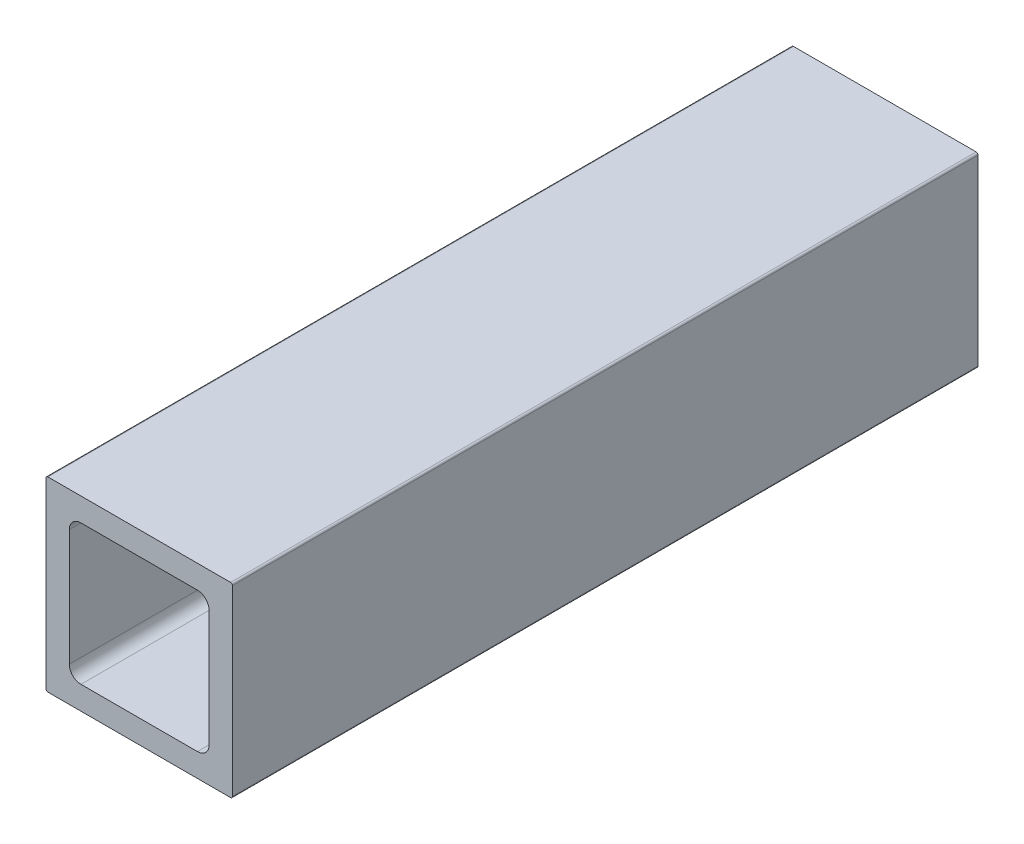
ISO-10303-21;
HEADER;
FILE_DESCRIPTION(('STEP AP214'),'2;1');
FILE_NAME('part.step','',(''),(''),'','','');
FILE_SCHEMA(('AUTOMOTIVE_DESIGN { 1 0 10303 214 1 1 1 1 }'));
ENDSEC;
DATA;
#1=APPLICATION_CONTEXT('core data for automotive mechanical design processes');
#2=APPLICATION_PROTOCOL_DEFINITION('international standard','automotive_design',2000,#1);
#3=PRODUCT_CONTEXT('',#1,'mechanical');
#4=PRODUCT('Part','Part','',(#3));
#5=PRODUCT_RELATED_PRODUCT_CATEGORY('part','',(#4));
#6=PRODUCT_DEFINITION_FORMATION('','',#4);
#7=PRODUCT_DEFINITION_CONTEXT('part definition',#1,'design');
#8=PRODUCT_DEFINITION('design','',#6,#7);
#9=PRODUCT_DEFINITION_SHAPE('','',#8);
#10=(LENGTH_UNIT() NAMED_UNIT(*) SI_UNIT(.MILLI.,.METRE.));
#11=(NAMED_UNIT(*) PLANE_ANGLE_UNIT() SI_UNIT($,.RADIAN.));
#12=(NAMED_UNIT(*) SI_UNIT($,.STERADIAN.) SOLID_ANGLE_UNIT());
#13=UNCERTAINTY_MEASURE_WITH_UNIT(LENGTH_MEASURE(1.E-05),#10,'distance_accuracy_value','');
#14=(GEOMETRIC_REPRESENTATION_CONTEXT(3) GLOBAL_UNCERTAINTY_ASSIGNED_CONTEXT((#13)) GLOBAL_UNIT_ASSIGNED_CONTEXT((#10,
#11,#12)) REPRESENTATION_CONTEXT('',''));
#15=CARTESIAN_POINT('',(0.,0.,0.));
#16=DIRECTION('',(0.,0.,1.));
#17=DIRECTION('',(1.,0.,0.));
#18=AXIS2_PLACEMENT_3D('',#15,#16,#17);
#19=CARTESIAN_POINT('',(3.175,4.7625,1828.8));
#20=DIRECTION('',(1.,0.,0.));
#21=DIRECTION('',(0.,1.,0.));
#22=AXIS2_PLACEMENT_3D('',#19,#20,#21);
#23=PLANE('',#22);
#24=DIRECTION('',(0.,-1.,0.));
#25=VECTOR('',#24,1.);
#26=CARTESIAN_POINT('',(3.175,4.7625,1727.2));
#27=LINE('',#26,#25);
#28=CARTESIAN_POINT('',(3.175,20.6375,1727.2));
#29=VERTEX_POINT('',#28);
#30=CARTESIAN_POINT('',(3.175,4.7625,1727.2));
#31=VERTEX_POINT('',#30);
#32=EDGE_CURVE('E55',#29,#31,#27,.T.);
#33=ORIENTED_EDGE('',*,*,#32,.F.);
#34=DIRECTION('',(0.,0.,-1.));
#35=VECTOR('',#34,1.);
#36=CARTESIAN_POINT('',(3.175,20.6375,1828.8));
#37=LINE('',#36,#35);
#38=CARTESIAN_POINT('',(3.175,20.6375,1828.8));
#39=VERTEX_POINT('',#38);
#40=EDGE_CURVE('E48',#39,#29,#37,.T.);
#41=ORIENTED_EDGE('',*,*,#40,.F.);
#42=DIRECTION('',(0.,-1.,0.));
#43=VECTOR('',#42,1.);
#44=CARTESIAN_POINT('',(3.175,4.7625,1828.8));
#45=LINE('',#44,#43);
#46=CARTESIAN_POINT('',(3.175,4.7625,1828.8));
#47=VERTEX_POINT('',#46);
#48=EDGE_CURVE('E214',#39,#47,#45,.T.);
#49=ORIENTED_EDGE('',*,*,#48,.T.);
#50=DIRECTION('',(0.,0.,-1.));
#51=VECTOR('',#50,1.);
#52=CARTESIAN_POINT('',(3.175,4.7625,1828.8));
#53=LINE('',#52,#51);
#54=EDGE_CURVE('E319',#47,#31,#53,.T.);
#55=ORIENTED_EDGE('',*,*,#54,.T.);
#56=EDGE_LOOP('',(#33,#41,#49,#55));
#57=FACE_BOUND('',#56,.T.);
#58=ADVANCED_FACE('F40',(#57),#23,.T.);
#59=CARTESIAN_POINT('',(4.7625,20.6375,1828.8));
#60=DIRECTION('',(0.,0.,-1.));
#61=DIRECTION('',(-1.,0.,0.));
#62=AXIS2_PLACEMENT_3D('',#59,#60,#61);
#63=CYLINDRICAL_SURFACE('',#62,1.5875);
#64=ORIENTED_EDGE('',*,*,#40,.T.);
#65=CARTESIAN_POINT('',(4.7625,20.6375,1727.2));
#66=DIRECTION('',(0.,0.,1.));
#67=DIRECTION('',(1.,0.,0.));
#68=AXIS2_PLACEMENT_3D('',#65,#66,#67);
#69=CIRCLE('',#68,1.5875);
#70=CARTESIAN_POINT('',(4.7625,22.225,1727.2));
#71=VERTEX_POINT('',#70);
#72=EDGE_CURVE('E299',#29,#71,#69,.F.);
#73=ORIENTED_EDGE('',*,*,#72,.T.);
#74=DIRECTION('',(0.,0.,-1.));
#75=VECTOR('',#74,1.);
#76=CARTESIAN_POINT('',(4.7625,22.225,1828.8));
#77=LINE('',#76,#75);
#78=CARTESIAN_POINT('',(4.7625,22.225,1828.8));
#79=VERTEX_POINT('',#78);
#80=EDGE_CURVE('E287',#79,#71,#77,.T.);
#81=ORIENTED_EDGE('',*,*,#80,.F.);
#82=CARTESIAN_POINT('',(4.7625,20.6375,1828.8));
#83=DIRECTION('',(0.,0.,1.));
#84=DIRECTION('',(-1.,0.,0.));
#85=AXIS2_PLACEMENT_3D('',#82,#83,#84);
#86=CIRCLE('',#85,1.5875);
#87=EDGE_CURVE('E219',#79,#39,#86,.T.);
#88=ORIENTED_EDGE('',*,*,#87,.T.);
#89=EDGE_LOOP('',(#64,#73,#81,#88));
#90=FACE_BOUND('',#89,.T.);
#91=ADVANCED_FACE('F297',(#90),#63,.F.);
#92=CARTESIAN_POINT('',(4.7625,22.225,1828.8));
#93=DIRECTION('',(0.,-1.,0.));
#94=DIRECTION('',(0.,0.,-1.));
#95=AXIS2_PLACEMENT_3D('',#92,#93,#94);
#96=PLANE('',#95);
#97=DIRECTION('',(-1.,0.,0.));
#98=VECTOR('',#97,1.);
#99=CARTESIAN_POINT('',(4.7625,22.225,1727.2));
#100=LINE('',#99,#98);
#101=CARTESIAN_POINT('',(20.6375,22.225,1727.2));
#102=VERTEX_POINT('',#101);
#103=EDGE_CURVE('E332',#102,#71,#100,.T.);
#104=ORIENTED_EDGE('',*,*,#103,.F.);
#105=DIRECTION('',(0.,0.,-1.));
#106=VECTOR('',#105,1.);
#107=CARTESIAN_POINT('',(20.6375,22.225,1828.8));
#108=LINE('',#107,#106);
#109=CARTESIAN_POINT('',(20.6375,22.225,1828.8));
#110=VERTEX_POINT('',#109);
#111=EDGE_CURVE('E234',#110,#102,#108,.T.);
#112=ORIENTED_EDGE('',*,*,#111,.F.);
#113=DIRECTION('',(-1.,0.,0.));
#114=VECTOR('',#113,1.);
#115=CARTESIAN_POINT('',(4.7625,22.225,1828.8));
#116=LINE('',#115,#114);
#117=EDGE_CURVE('E223',#110,#79,#116,.T.);
#118=ORIENTED_EDGE('',*,*,#117,.T.);
#119=ORIENTED_EDGE('',*,*,#80,.T.);
#120=EDGE_LOOP('',(#104,#112,#118,#119));
#121=FACE_BOUND('',#120,.T.);
#122=ADVANCED_FACE('F286',(#121),#96,.T.);
#123=CARTESIAN_POINT('',(20.6375,20.6375,1828.8));
#124=DIRECTION('',(0.,0.,-1.));
#125=DIRECTION('',(-1.,0.,0.));
#126=AXIS2_PLACEMENT_3D('',#123,#124,#125);
#127=CYLINDRICAL_SURFACE('',#126,1.5875);
#128=ORIENTED_EDGE('',*,*,#111,.T.);
#129=CARTESIAN_POINT('',(20.6375,20.6375,1727.2));
#130=DIRECTION('',(0.,0.,1.));
#131=DIRECTION('',(1.,0.,0.));
#132=AXIS2_PLACEMENT_3D('',#129,#130,#131);
#133=CIRCLE('',#132,1.5875);
#134=CARTESIAN_POINT('',(22.225,20.6375,1727.2));
#135=VERTEX_POINT('',#134);
#136=EDGE_CURVE('E334',#102,#135,#133,.F.);
#137=ORIENTED_EDGE('',*,*,#136,.T.);
#138=DIRECTION('',(0.,0.,-1.));
#139=VECTOR('',#138,1.);
#140=CARTESIAN_POINT('',(22.225,20.6375,1828.8));
#141=LINE('',#140,#139);
#142=CARTESIAN_POINT('',(22.225,20.6375,1828.8));
#143=VERTEX_POINT('',#142);
#144=EDGE_CURVE('E230',#143,#135,#141,.T.);
#145=ORIENTED_EDGE('',*,*,#144,.F.);
#146=CARTESIAN_POINT('',(20.6375,20.6375,1828.8));
#147=DIRECTION('',(0.,0.,1.));
#148=DIRECTION('',(-1.,0.,0.));
#149=AXIS2_PLACEMENT_3D('',#146,#147,#148);
#150=CIRCLE('',#149,1.5875);
#151=EDGE_CURVE('E209',#143,#110,#150,.T.);
#152=ORIENTED_EDGE('',*,*,#151,.T.);
#153=EDGE_LOOP('',(#128,#137,#145,#152));
#154=FACE_BOUND('',#153,.T.);
#155=ADVANCED_FACE('F489',(#154),#127,.F.);
#156=CARTESIAN_POINT('',(22.225,4.7625,1828.8));
#157=DIRECTION('',(-1.,0.,0.));
#158=DIRECTION('',(0.,0.,1.));
#159=AXIS2_PLACEMENT_3D('',#156,#157,#158);
#160=PLANE('',#159);
#161=DIRECTION('',(0.,1.,0.));
#162=VECTOR('',#161,1.);
#163=CARTESIAN_POINT('',(22.225,4.7625,1727.2));
#164=LINE('',#163,#162);
#165=CARTESIAN_POINT('',(22.225,4.7625,1727.2));
#166=VERTEX_POINT('',#165);
#167=EDGE_CURVE('E337',#166,#135,#164,.T.);
#168=ORIENTED_EDGE('',*,*,#167,.F.);
#169=DIRECTION('',(0.,0.,-1.));
#170=VECTOR('',#169,1.);
#171=CARTESIAN_POINT('',(22.225,4.7625,1828.8));
#172=LINE('',#171,#170);
#173=CARTESIAN_POINT('',(22.225,4.7625,1828.8));
#174=VERTEX_POINT('',#173);
#175=EDGE_CURVE('E235',#174,#166,#172,.T.);
#176=ORIENTED_EDGE('',*,*,#175,.F.);
#177=DIRECTION('',(0.,1.,0.));
#178=VECTOR('',#177,1.);
#179=CARTESIAN_POINT('',(22.225,4.7625,1828.8));
#180=LINE('',#179,#178);
#181=EDGE_CURVE('E205',#174,#143,#180,.T.);
#182=ORIENTED_EDGE('',*,*,#181,.T.);
#183=ORIENTED_EDGE('',*,*,#144,.T.);
#184=EDGE_LOOP('',(#168,#176,#182,#183));
#185=FACE_BOUND('',#184,.T.);
#186=ADVANCED_FACE('F388',(#185),#160,.T.);
#187=CARTESIAN_POINT('',(20.6375,4.7625,1828.8));
#188=DIRECTION('',(0.,0.,-1.));
#189=DIRECTION('',(-1.,0.,0.));
#190=AXIS2_PLACEMENT_3D('',#187,#188,#189);
#191=CYLINDRICAL_SURFACE('',#190,1.5875);
#192=ORIENTED_EDGE('',*,*,#175,.T.);
#193=CARTESIAN_POINT('',(20.6375,4.7625,1727.2));
#194=DIRECTION('',(0.,0.,1.));
#195=DIRECTION('',(1.,0.,0.));
#196=AXIS2_PLACEMENT_3D('',#193,#194,#195);
#197=CIRCLE('',#196,1.5875);
#198=CARTESIAN_POINT('',(20.6375,3.175,1727.2));
#199=VERTEX_POINT('',#198);
#200=EDGE_CURVE('E339',#166,#199,#197,.F.);
#201=ORIENTED_EDGE('',*,*,#200,.T.);
#202=DIRECTION('',(0.,0.,-1.));
#203=VECTOR('',#202,1.);
#204=CARTESIAN_POINT('',(20.6375,3.175,1828.8));
#205=LINE('',#204,#203);
#206=CARTESIAN_POINT('',(20.6375,3.175,1828.8));
#207=VERTEX_POINT('',#206);
#208=EDGE_CURVE('E261',#207,#199,#205,.T.);
#209=ORIENTED_EDGE('',*,*,#208,.F.);
#210=CARTESIAN_POINT('',(20.6375,4.7625,1828.8));
#211=DIRECTION('',(0.,0.,1.));
#212=DIRECTION('',(-1.,0.,0.));
#213=AXIS2_PLACEMENT_3D('',#210,#211,#212);
#214=CIRCLE('',#213,1.5875);
#215=EDGE_CURVE('E208',#207,#174,#214,.T.);
#216=ORIENTED_EDGE('',*,*,#215,.T.);
#217=EDGE_LOOP('',(#192,#201,#209,#216));
#218=FACE_BOUND('',#217,.T.);
#219=ADVANCED_FACE('F385',(#218),#191,.F.);
#220=CARTESIAN_POINT('',(4.7625,3.175,1828.8));
#221=DIRECTION('',(0.,1.,0.));
#222=DIRECTION('',(1.,0.,0.));
#223=AXIS2_PLACEMENT_3D('',#220,#221,#222);
#224=PLANE('',#223);
#225=DIRECTION('',(1.,0.,0.));
#226=VECTOR('',#225,1.);
#227=CARTESIAN_POINT('',(4.7625,3.175,1727.2));
#228=LINE('',#227,#226);
#229=CARTESIAN_POINT('',(4.7625,3.175,1727.2));
#230=VERTEX_POINT('',#229);
#231=EDGE_CURVE('E342',#230,#199,#228,.T.);
#232=ORIENTED_EDGE('',*,*,#231,.F.);
#233=DIRECTION('',(0.,0.,-1.));
#234=VECTOR('',#233,1.);
#235=CARTESIAN_POINT('',(4.7625,3.175,1828.8));
#236=LINE('',#235,#234);
#237=CARTESIAN_POINT('',(4.7625,3.175,1828.8));
#238=VERTEX_POINT('',#237);
#239=EDGE_CURVE('E265',#238,#230,#236,.T.);
#240=ORIENTED_EDGE('',*,*,#239,.F.);
#241=DIRECTION('',(1.,0.,0.));
#242=VECTOR('',#241,1.);
#243=CARTESIAN_POINT('',(4.7625,3.175,1828.8));
#244=LINE('',#243,#242);
#245=EDGE_CURVE('E251',#238,#207,#244,.T.);
#246=ORIENTED_EDGE('',*,*,#245,.T.);
#247=ORIENTED_EDGE('',*,*,#208,.T.);
#248=EDGE_LOOP('',(#232,#240,#246,#247));
#249=FACE_BOUND('',#248,.T.);
#250=ADVANCED_FACE('F387',(#249),#224,.T.);
#251=CARTESIAN_POINT('',(4.7625,4.7625,1828.8));
#252=DIRECTION('',(0.,0.,-1.));
#253=DIRECTION('',(-1.,0.,0.));
#254=AXIS2_PLACEMENT_3D('',#251,#252,#253);
#255=CYLINDRICAL_SURFACE('',#254,1.5875);
#256=ORIENTED_EDGE('',*,*,#239,.T.);
#257=CARTESIAN_POINT('',(4.7625,4.7625,1727.2));
#258=DIRECTION('',(0.,0.,1.));
#259=DIRECTION('',(1.,0.,0.));
#260=AXIS2_PLACEMENT_3D('',#257,#258,#259);
#261=CIRCLE('',#260,1.5875);
#262=EDGE_CURVE('E344',#230,#31,#261,.F.);
#263=ORIENTED_EDGE('',*,*,#262,.T.);
#264=ORIENTED_EDGE('',*,*,#54,.F.);
#265=CARTESIAN_POINT('',(4.7625,4.7625,1828.8));
#266=DIRECTION('',(0.,0.,1.));
#267=DIRECTION('',(1.,0.,0.));
#268=AXIS2_PLACEMENT_3D('',#265,#266,#267);
#269=CIRCLE('',#268,1.5875);
#270=EDGE_CURVE('E210',#47,#238,#269,.T.);
#271=ORIENTED_EDGE('',*,*,#270,.T.);
#272=EDGE_LOOP('',(#256,#263,#264,#271));
#273=FACE_BOUND('',#272,.T.);
#274=ADVANCED_FACE('F423',(#273),#255,.F.);
#275=CARTESIAN_POINT('',(0.,0.254,1828.8));
#276=DIRECTION('',(1.,0.,0.));
#277=DIRECTION('',(0.,1.,0.));
#278=AXIS2_PLACEMENT_3D('',#275,#276,#277);
#279=PLANE('',#278);
#280=DIRECTION('',(0.,0.,-1.));
#281=VECTOR('',#280,1.);
#282=CARTESIAN_POINT('',(0.,25.146,1828.8));
#283=LINE('',#282,#281);
#284=CARTESIAN_POINT('',(0.,25.146,1828.8));
#285=VERTEX_POINT('',#284);
#286=CARTESIAN_POINT('',(0.,25.146,1727.2));
#287=VERTEX_POINT('',#286);
#288=EDGE_CURVE('E260',#285,#287,#283,.T.);
#289=ORIENTED_EDGE('',*,*,#288,.T.);
#290=DIRECTION('',(0.,-1.,0.));
#291=VECTOR('',#290,1.);
#292=CARTESIAN_POINT('',(0.,0.254,1727.2));
#293=LINE('',#292,#291);
#294=CARTESIAN_POINT('',(0.,0.254,1727.2));
#295=VERTEX_POINT('',#294);
#296=EDGE_CURVE('E182',#287,#295,#293,.T.);
#297=ORIENTED_EDGE('',*,*,#296,.T.);
#298=DIRECTION('',(0.,0.,-1.));
#299=VECTOR('',#298,1.);
#300=CARTESIAN_POINT('',(0.,0.254,1828.8));
#301=LINE('',#300,#299);
#302=CARTESIAN_POINT('',(0.,0.254,1828.8));
#303=VERTEX_POINT('',#302);
#304=EDGE_CURVE('E191',#303,#295,#301,.T.);
#305=ORIENTED_EDGE('',*,*,#304,.F.);
#306=DIRECTION('',(0.,-1.,0.));
#307=VECTOR('',#306,1.);
#308=CARTESIAN_POINT('',(0.,0.254,1828.8));
#309=LINE('',#308,#307);
#310=EDGE_CURVE('E215',#285,#303,#309,.T.);
#311=ORIENTED_EDGE('',*,*,#310,.F.);
#312=EDGE_LOOP('',(#289,#297,#305,#311));
#313=FACE_BOUND('',#312,.T.);
#314=ADVANCED_FACE('F417',(#313),#279,.F.);
#315=CARTESIAN_POINT('',(0.254,25.146,1828.8));
#316=DIRECTION('',(0.,0.,-1.));
#317=DIRECTION('',(-1.,0.,0.));
#318=AXIS2_PLACEMENT_3D('',#315,#316,#317);
#319=CYLINDRICAL_SURFACE('',#318,0.254);
#320=CARTESIAN_POINT('',(0.254,25.146,1727.2));
#321=DIRECTION('',(0.,0.,1.));
#322=DIRECTION('',(1.,0.,0.));
#323=AXIS2_PLACEMENT_3D('',#320,#321,#322);
#324=CIRCLE('',#323,0.254);
#325=CARTESIAN_POINT('',(0.254000000000004,25.4,1727.2));
#326=VERTEX_POINT('',#325);
#327=EDGE_CURVE('E173',#287,#326,#324,.F.);
#328=ORIENTED_EDGE('',*,*,#327,.F.);
#329=ORIENTED_EDGE('',*,*,#288,.F.);
#330=CARTESIAN_POINT('',(0.254,25.146,1828.8));
#331=DIRECTION('',(0.,0.,1.));
#332=DIRECTION('',(-1.,0.,0.));
#333=AXIS2_PLACEMENT_3D('',#330,#331,#332);
#334=CIRCLE('',#333,0.254);
#335=CARTESIAN_POINT('',(0.254,25.4,1828.8));
#336=VERTEX_POINT('',#335);
#337=EDGE_CURVE('E236',#336,#285,#334,.T.);
#338=ORIENTED_EDGE('',*,*,#337,.F.);
#339=DIRECTION('',(0.,0.,-1.));
#340=VECTOR('',#339,1.);
#341=CARTESIAN_POINT('',(0.254,25.4,1828.8));
#342=LINE('',#341,#340);
#343=EDGE_CURVE('E256',#336,#326,#342,.T.);
#344=ORIENTED_EDGE('',*,*,#343,.T.);
#345=EDGE_LOOP('',(#328,#329,#338,#344));
#346=FACE_BOUND('',#345,.T.);
#347=ADVANCED_FACE('F422',(#346),#319,.T.);
#348=CARTESIAN_POINT('',(0.254,25.4,1828.8));
#349=DIRECTION('',(0.,-1.,0.));
#350=DIRECTION('',(0.,0.,-1.));
#351=AXIS2_PLACEMENT_3D('',#348,#349,#350);
#352=PLANE('',#351);
#353=DIRECTION('',(0.,0.,-1.));
#354=VECTOR('',#353,1.);
#355=CARTESIAN_POINT('',(25.146,25.4,1828.8));
#356=LINE('',#355,#354);
#357=CARTESIAN_POINT('',(25.146,25.4,1828.8));
#358=VERTEX_POINT('',#357);
#359=CARTESIAN_POINT('',(25.146,25.4,1727.2));
#360=VERTEX_POINT('',#359);
#361=EDGE_CURVE('E252',#358,#360,#356,.T.);
#362=ORIENTED_EDGE('',*,*,#361,.T.);
#363=DIRECTION('',(1.,0.,0.));
#364=VECTOR('',#363,1.);
#365=CARTESIAN_POINT('',(-135.222379220066,25.4,1727.2));
#366=LINE('',#365,#364);
#367=EDGE_CURVE('E183',#326,#360,#366,.T.);
#368=ORIENTED_EDGE('',*,*,#367,.F.);
#369=ORIENTED_EDGE('',*,*,#343,.F.);
#370=DIRECTION('',(-1.,0.,0.));
#371=VECTOR('',#370,1.);
#372=CARTESIAN_POINT('',(0.254,25.4,1828.8));
#373=LINE('',#372,#371);
#374=EDGE_CURVE('E228',#358,#336,#373,.T.);
#375=ORIENTED_EDGE('',*,*,#374,.F.);
#376=EDGE_LOOP('',(#362,#368,#369,#375));
#377=FACE_BOUND('',#376,.T.);
#378=ADVANCED_FACE('F359',(#377),#352,.F.);
#379=CARTESIAN_POINT('',(25.146,25.146,1828.8));
#380=DIRECTION('',(0.,0.,-1.));
#381=DIRECTION('',(-1.,0.,0.));
#382=AXIS2_PLACEMENT_3D('',#379,#380,#381);
#383=CYLINDRICAL_SURFACE('',#382,0.254);
#384=CARTESIAN_POINT('',(25.146,25.146,1727.2));
#385=DIRECTION('',(0.,0.,1.));
#386=DIRECTION('',(1.,0.,0.));
#387=AXIS2_PLACEMENT_3D('',#384,#385,#386);
#388=CIRCLE('',#387,0.254);
#389=CARTESIAN_POINT('',(25.4,25.146,1727.2));
#390=VERTEX_POINT('',#389);
#391=EDGE_CURVE('E346',#360,#390,#388,.F.);
#392=ORIENTED_EDGE('',*,*,#391,.F.);
#393=ORIENTED_EDGE('',*,*,#361,.F.);
#394=CARTESIAN_POINT('',(25.146,25.146,1828.8));
#395=DIRECTION('',(0.,0.,1.));
#396=DIRECTION('',(-1.,0.,0.));
#397=AXIS2_PLACEMENT_3D('',#394,#395,#396);
#398=CIRCLE('',#397,0.254);
#399=CARTESIAN_POINT('',(25.4,25.146,1828.8));
#400=VERTEX_POINT('',#399);
#401=EDGE_CURVE('E224',#400,#358,#398,.T.);
#402=ORIENTED_EDGE('',*,*,#401,.F.);
#403=DIRECTION('',(0.,0.,-1.));
#404=VECTOR('',#403,1.);
#405=CARTESIAN_POINT('',(25.4,25.146,1828.8));
#406=LINE('',#405,#404);
#407=EDGE_CURVE('E197',#400,#390,#406,.T.);
#408=ORIENTED_EDGE('',*,*,#407,.T.);
#409=EDGE_LOOP('',(#392,#393,#402,#408));
#410=FACE_BOUND('',#409,.T.);
#411=ADVANCED_FACE('F42',(#410),#383,.T.);
#412=CARTESIAN_POINT('',(25.4,0.254,1828.8));
#413=DIRECTION('',(-1.,0.,0.));
#414=DIRECTION('',(0.,0.,1.));
#415=AXIS2_PLACEMENT_3D('',#412,#413,#414);
#416=PLANE('',#415);
#417=DIRECTION('',(0.,0.,-1.));
#418=VECTOR('',#417,1.);
#419=CARTESIAN_POINT('',(25.4,0.254,1828.8));
#420=LINE('',#419,#418);
#421=CARTESIAN_POINT('',(25.4,0.254,1828.8));
#422=VERTEX_POINT('',#421);
#423=CARTESIAN_POINT('',(25.4,0.254,1727.2));
#424=VERTEX_POINT('',#423);
#425=EDGE_CURVE('E190',#422,#424,#420,.T.);
#426=ORIENTED_EDGE('',*,*,#425,.T.);
#427=DIRECTION('',(0.,1.,0.));
#428=VECTOR('',#427,1.);
#429=CARTESIAN_POINT('',(25.4,0.254,1727.2));
#430=LINE('',#429,#428);
#431=EDGE_CURVE('E169',#424,#390,#430,.T.);
#432=ORIENTED_EDGE('',*,*,#431,.T.);
#433=ORIENTED_EDGE('',*,*,#407,.F.);
#434=DIRECTION('',(0.,1.,0.));
#435=VECTOR('',#434,1.);
#436=CARTESIAN_POINT('',(25.4,0.254,1828.8));
#437=LINE('',#436,#435);
#438=EDGE_CURVE('E229',#422,#400,#437,.T.);
#439=ORIENTED_EDGE('',*,*,#438,.F.);
#440=EDGE_LOOP('',(#426,#432,#433,#439));
#441=FACE_BOUND('',#440,.T.);
#442=ADVANCED_FACE('F363',(#441),#416,.F.);
#443=CARTESIAN_POINT('',(25.146,0.254,1828.8));
#444=DIRECTION('',(0.,0.,-1.));
#445=DIRECTION('',(-1.,0.,0.));
#446=AXIS2_PLACEMENT_3D('',#443,#444,#445);
#447=CYLINDRICAL_SURFACE('',#446,0.254);
#448=CARTESIAN_POINT('',(25.146,0.254,1727.2));
#449=DIRECTION('',(0.,0.,1.));
#450=DIRECTION('',(1.,0.,0.));
#451=AXIS2_PLACEMENT_3D('',#448,#449,#450);
#452=CIRCLE('',#451,0.254);
#453=CARTESIAN_POINT('',(25.146,0.,1727.2));
#454=VERTEX_POINT('',#453);
#455=EDGE_CURVE('E166',#424,#454,#452,.F.);
#456=ORIENTED_EDGE('',*,*,#455,.F.);
#457=ORIENTED_EDGE('',*,*,#425,.F.);
#458=CARTESIAN_POINT('',(25.146,0.254,1828.8));
#459=DIRECTION('',(0.,0.,1.));
#460=DIRECTION('',(1.,0.,0.));
#461=AXIS2_PLACEMENT_3D('',#458,#459,#460);
#462=CIRCLE('',#461,0.254);
#463=CARTESIAN_POINT('',(25.146,0.,1828.8));
#464=VERTEX_POINT('',#463);
#465=EDGE_CURVE('E187',#464,#422,#462,.T.);
#466=ORIENTED_EDGE('',*,*,#465,.F.);
#467=DIRECTION('',(0.,0.,-1.));
#468=VECTOR('',#467,1.);
#469=CARTESIAN_POINT('',(25.146,0.,1828.8));
#470=LINE('',#469,#468);
#471=EDGE_CURVE('E179',#464,#454,#470,.T.);
#472=ORIENTED_EDGE('',*,*,#471,.T.);
#473=EDGE_LOOP('',(#456,#457,#466,#472));
#474=FACE_BOUND('',#473,.T.);
#475=ADVANCED_FACE('F185',(#474),#447,.T.);
#476=CARTESIAN_POINT('',(0.254,0.,1828.8));
#477=DIRECTION('',(0.,1.,0.));
#478=DIRECTION('',(1.,0.,0.));
#479=AXIS2_PLACEMENT_3D('',#476,#477,#478);
#480=PLANE('',#479);
#481=DIRECTION('',(0.,0.,-1.));
#482=VECTOR('',#481,1.);
#483=CARTESIAN_POINT('',(0.254,0.,1828.8));
#484=LINE('',#483,#482);
#485=CARTESIAN_POINT('',(0.254,0.,1828.8));
#486=VERTEX_POINT('',#485);
#487=CARTESIAN_POINT('',(0.254,0.,1727.2));
#488=VERTEX_POINT('',#487);
#489=EDGE_CURVE('E181',#486,#488,#484,.T.);
#490=ORIENTED_EDGE('',*,*,#489,.T.);
#491=DIRECTION('',(-1.,0.,0.));
#492=VECTOR('',#491,1.);
#493=CARTESIAN_POINT('',(-135.222379220066,0.,1727.2));
#494=LINE('',#493,#492);
#495=EDGE_CURVE('E62',#454,#488,#494,.T.);
#496=ORIENTED_EDGE('',*,*,#495,.F.);
#497=ORIENTED_EDGE('',*,*,#471,.F.);
#498=DIRECTION('',(1.,0.,0.));
#499=VECTOR('',#498,1.);
#500=CARTESIAN_POINT('',(0.254,0.,1828.8));
#501=LINE('',#500,#499);
#502=EDGE_CURVE('E245',#486,#464,#501,.T.);
#503=ORIENTED_EDGE('',*,*,#502,.F.);
#504=EDGE_LOOP('',(#490,#496,#497,#503));
#505=FACE_BOUND('',#504,.T.);
#506=ADVANCED_FACE('F177',(#505),#480,.F.);
#507=CARTESIAN_POINT('',(0.254,0.254,1828.8));
#508=DIRECTION('',(0.,0.,-1.));
#509=DIRECTION('',(-1.,0.,0.));
#510=AXIS2_PLACEMENT_3D('',#507,#508,#509);
#511=CYLINDRICAL_SURFACE('',#510,0.254);
#512=CARTESIAN_POINT('',(0.254,0.254,1727.2));
#513=DIRECTION('',(0.,0.,1.));
#514=DIRECTION('',(1.,0.,0.));
#515=AXIS2_PLACEMENT_3D('',#512,#513,#514);
#516=CIRCLE('',#515,0.254);
#517=EDGE_CURVE('E11',#488,#295,#516,.F.);
#518=ORIENTED_EDGE('',*,*,#517,.F.);
#519=ORIENTED_EDGE('',*,*,#489,.F.);
#520=CARTESIAN_POINT('',(0.254,0.254,1828.8));
#521=DIRECTION('',(0.,0.,1.));
#522=DIRECTION('',(-1.,0.,0.));
#523=AXIS2_PLACEMENT_3D('',#520,#521,#522);
#524=CIRCLE('',#523,0.254);
#525=EDGE_CURVE('E248',#303,#486,#524,.T.);
#526=ORIENTED_EDGE('',*,*,#525,.F.);
#527=ORIENTED_EDGE('',*,*,#304,.T.);
#528=EDGE_LOOP('',(#518,#519,#526,#527));
#529=FACE_BOUND('',#528,.T.);
#530=ADVANCED_FACE('F381',(#529),#511,.T.);
#531=CARTESIAN_POINT('',(0.254,0.254,1828.8));
#532=DIRECTION('',(0.,0.,-1.));
#533=DIRECTION('',(0.,-1.,0.));
#534=AXIS2_PLACEMENT_3D('',#531,#532,#533);
#535=PLANE('',#534);
#536=ORIENTED_EDGE('',*,*,#270,.F.);
#537=ORIENTED_EDGE('',*,*,#48,.F.);
#538=ORIENTED_EDGE('',*,*,#87,.F.);
#539=ORIENTED_EDGE('',*,*,#117,.F.);
#540=ORIENTED_EDGE('',*,*,#151,.F.);
#541=ORIENTED_EDGE('',*,*,#181,.F.);
#542=ORIENTED_EDGE('',*,*,#215,.F.);
#543=ORIENTED_EDGE('',*,*,#245,.F.);
#544=EDGE_LOOP('',(#536,#537,#538,#539,#540,#541,#542,#543));
#545=FACE_BOUND('',#544,.T.);
#546=ORIENTED_EDGE('',*,*,#525,.T.);
#547=ORIENTED_EDGE('',*,*,#502,.T.);
#548=ORIENTED_EDGE('',*,*,#465,.T.);
#549=ORIENTED_EDGE('',*,*,#438,.T.);
#550=ORIENTED_EDGE('',*,*,#401,.T.);
#551=ORIENTED_EDGE('',*,*,#374,.T.);
#552=ORIENTED_EDGE('',*,*,#337,.T.);
#553=ORIENTED_EDGE('',*,*,#310,.T.);
#554=EDGE_LOOP('',(#546,#547,#548,#549,#550,#551,#552,#553));
#555=FACE_BOUND('',#554,.T.);
#556=ADVANCED_FACE('F293',(#545,#555),#535,.F.);
#557=CARTESIAN_POINT('',(-135.222379220066,-1748.22883004139,1727.2));
#558=DIRECTION('',(0.,0.,1.));
#559=DIRECTION('',(1.,0.,0.));
#560=AXIS2_PLACEMENT_3D('',#557,#558,#559);
#561=PLANE('',#560);
#562=ORIENTED_EDGE('',*,*,#32,.T.);
#563=ORIENTED_EDGE('',*,*,#262,.F.);
#564=ORIENTED_EDGE('',*,*,#231,.T.);
#565=ORIENTED_EDGE('',*,*,#200,.F.);
#566=ORIENTED_EDGE('',*,*,#167,.T.);
#567=ORIENTED_EDGE('',*,*,#136,.F.);
#568=ORIENTED_EDGE('',*,*,#103,.T.);
#569=ORIENTED_EDGE('',*,*,#72,.F.);
#570=EDGE_LOOP('',(#562,#563,#564,#565,#566,#567,#568,#569));
#571=FACE_BOUND('',#570,.T.);
#572=ORIENTED_EDGE('',*,*,#391,.T.);
#573=ORIENTED_EDGE('',*,*,#431,.F.);
#574=ORIENTED_EDGE('',*,*,#455,.T.);
#575=ORIENTED_EDGE('',*,*,#495,.T.);
#576=ORIENTED_EDGE('',*,*,#517,.T.);
#577=ORIENTED_EDGE('',*,*,#296,.F.);
#578=ORIENTED_EDGE('',*,*,#327,.T.);
#579=ORIENTED_EDGE('',*,*,#367,.T.);
#580=EDGE_LOOP('',(#572,#573,#574,#575,#576,#577,#578,#579));
#581=FACE_BOUND('',#580,.T.);
#582=ADVANCED_FACE('F167',(#571,#581),#561,.F.);
#583=CLOSED_SHELL('',(#58,#91,#122,#155,#186,#219,#250,#274,#314,#347,#378,#411,#442,#475,#506,
#530,#556,#582));
#584=MANIFOLD_SOLID_BREP('B2',#583);
#585=ADVANCED_BREP_SHAPE_REPRESENTATION('',(#18,#584),#14);
#586=SHAPE_DEFINITION_REPRESENTATION(#9,#585);
ENDSEC;
END-ISO-10303-21;
